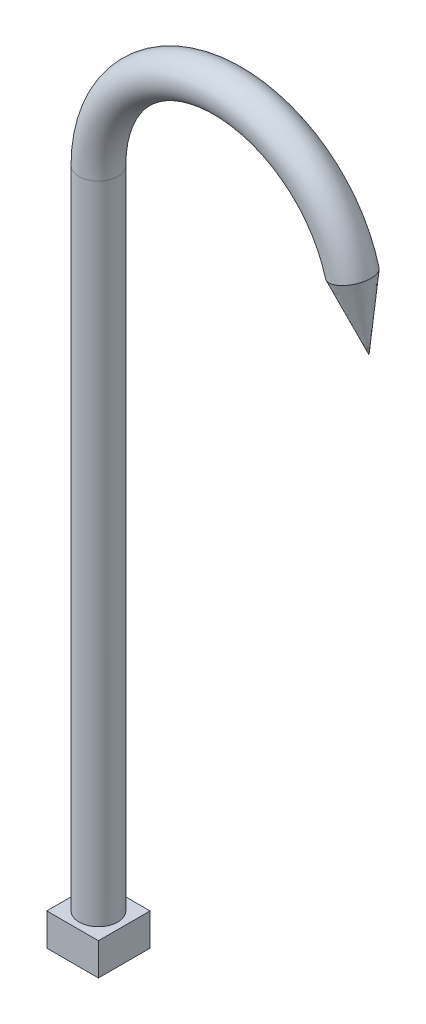
ISO-10303-21;
HEADER;
FILE_DESCRIPTION(('STEP AP214'),'2;1');
FILE_NAME('part.step','',(''),(''),'','','');
FILE_SCHEMA(('AUTOMOTIVE_DESIGN { 1 0 10303 214 1 1 1 1 }'));
ENDSEC;
DATA;
#1=APPLICATION_CONTEXT('core data for automotive mechanical design processes');
#2=APPLICATION_PROTOCOL_DEFINITION('international standard','automotive_design',2000,#1);
#3=PRODUCT_CONTEXT('',#1,'mechanical');
#4=PRODUCT('Part','Part','',(#3));
#5=PRODUCT_RELATED_PRODUCT_CATEGORY('part','',(#4));
#6=PRODUCT_DEFINITION_FORMATION('','',#4);
#7=PRODUCT_DEFINITION_CONTEXT('part definition',#1,'design');
#8=PRODUCT_DEFINITION('design','',#6,#7);
#9=PRODUCT_DEFINITION_SHAPE('','',#8);
#10=(LENGTH_UNIT() NAMED_UNIT(*) SI_UNIT(.MILLI.,.METRE.));
#11=(NAMED_UNIT(*) PLANE_ANGLE_UNIT() SI_UNIT($,.RADIAN.));
#12=(NAMED_UNIT(*) SI_UNIT($,.STERADIAN.) SOLID_ANGLE_UNIT());
#13=UNCERTAINTY_MEASURE_WITH_UNIT(LENGTH_MEASURE(1.E-05),#10,'distance_accuracy_value','');
#14=(GEOMETRIC_REPRESENTATION_CONTEXT(3) GLOBAL_UNCERTAINTY_ASSIGNED_CONTEXT((#13)) GLOBAL_UNIT_ASSIGNED_CONTEXT((#10,
#11,#12)) REPRESENTATION_CONTEXT('',''));
#15=CARTESIAN_POINT('',(0.,0.,0.));
#16=DIRECTION('',(0.,0.,1.));
#17=DIRECTION('',(1.,0.,0.));
#18=AXIS2_PLACEMENT_3D('',#15,#16,#17);
#19=CARTESIAN_POINT('',(0.,5.,0.));
#20=DIRECTION('',(0.,-1.,0.));
#21=DIRECTION('',(0.,0.,-1.));
#22=AXIS2_PLACEMENT_3D('',#19,#20,#21);
#23=PLANE('',#22);
#24=DIRECTION('',(0.,0.,-1.));
#25=VECTOR('',#24,1.);
#26=CARTESIAN_POINT('',(4.,5.,4.));
#27=LINE('',#26,#25);
#28=CARTESIAN_POINT('',(4.,5.,4.));
#29=VERTEX_POINT('',#28);
#30=CARTESIAN_POINT('',(4.,5.,-4.));
#31=VERTEX_POINT('',#30);
#32=EDGE_CURVE('E84',#29,#31,#27,.T.);
#33=ORIENTED_EDGE('',*,*,#32,.T.);
#34=DIRECTION('',(-1.,0.,0.));
#35=VECTOR('',#34,1.);
#36=CARTESIAN_POINT('',(-4.,5.,-4.));
#37=LINE('',#36,#35);
#38=CARTESIAN_POINT('',(-4.,5.,-4.));
#39=VERTEX_POINT('',#38);
#40=EDGE_CURVE('E78',#31,#39,#37,.T.);
#41=ORIENTED_EDGE('',*,*,#40,.T.);
#42=DIRECTION('',(0.,0.,1.));
#43=VECTOR('',#42,1.);
#44=CARTESIAN_POINT('',(-4.,5.,4.));
#45=LINE('',#44,#43);
#46=CARTESIAN_POINT('',(-4.,5.,4.));
#47=VERTEX_POINT('',#46);
#48=EDGE_CURVE('E81',#39,#47,#45,.T.);
#49=ORIENTED_EDGE('',*,*,#48,.T.);
#50=DIRECTION('',(1.,0.,0.));
#51=VECTOR('',#50,1.);
#52=CARTESIAN_POINT('',(-4.,5.,4.));
#53=LINE('',#52,#51);
#54=EDGE_CURVE('E50',#47,#29,#53,.T.);
#55=ORIENTED_EDGE('',*,*,#54,.T.);
#56=EDGE_LOOP('',(#33,#41,#49,#55));
#57=FACE_BOUND('',#56,.T.);
#58=CARTESIAN_POINT('',(0.,5.,0.));
#59=DIRECTION('',(0.,1.,0.));
#60=DIRECTION('',(0.,0.,1.));
#61=AXIS2_PLACEMENT_3D('',#58,#59,#60);
#62=CIRCLE('',#61,3.);
#63=CARTESIAN_POINT('',(0.,5.,3.));
#64=VERTEX_POINT('',#63);
#65=EDGE_CURVE('E11',#64,#64,#62,.T.);
#66=ORIENTED_EDGE('',*,*,#65,.F.);
#67=EDGE_LOOP('',(#66));
#68=FACE_BOUND('',#67,.T.);
#69=ADVANCED_FACE('F32',(#57,#68),#23,.F.);
#70=CARTESIAN_POINT('',(4.,5.,4.));
#71=DIRECTION('',(-1.,0.,0.));
#72=DIRECTION('',(0.,0.,1.));
#73=AXIS2_PLACEMENT_3D('',#70,#71,#72);
#74=PLANE('',#73);
#75=DIRECTION('',(0.,0.,-1.));
#76=VECTOR('',#75,1.);
#77=CARTESIAN_POINT('',(4.,0.,4.));
#78=LINE('',#77,#76);
#79=CARTESIAN_POINT('',(4.,0.,4.));
#80=VERTEX_POINT('',#79);
#81=CARTESIAN_POINT('',(4.,0.,-4.));
#82=VERTEX_POINT('',#81);
#83=EDGE_CURVE('E100',#80,#82,#78,.T.);
#84=ORIENTED_EDGE('',*,*,#83,.T.);
#85=DIRECTION('',(0.,-1.,0.));
#86=VECTOR('',#85,1.);
#87=CARTESIAN_POINT('',(4.,5.,-4.));
#88=LINE('',#87,#86);
#89=EDGE_CURVE('E36',#31,#82,#88,.T.);
#90=ORIENTED_EDGE('',*,*,#89,.F.);
#91=ORIENTED_EDGE('',*,*,#32,.F.);
#92=DIRECTION('',(0.,-1.,0.));
#93=VECTOR('',#92,1.);
#94=CARTESIAN_POINT('',(4.,5.,4.));
#95=LINE('',#94,#93);
#96=EDGE_CURVE('E96',#29,#80,#95,.T.);
#97=ORIENTED_EDGE('',*,*,#96,.T.);
#98=EDGE_LOOP('',(#84,#90,#91,#97));
#99=FACE_BOUND('',#98,.T.);
#100=ADVANCED_FACE('F114',(#99),#74,.F.);
#101=CARTESIAN_POINT('',(-4.,5.,-4.));
#102=DIRECTION('',(0.,0.,1.));
#103=DIRECTION('',(1.,0.,0.));
#104=AXIS2_PLACEMENT_3D('',#101,#102,#103);
#105=PLANE('',#104);
#106=DIRECTION('',(-1.,0.,0.));
#107=VECTOR('',#106,1.);
#108=CARTESIAN_POINT('',(-4.,0.,-4.));
#109=LINE('',#108,#107);
#110=CARTESIAN_POINT('',(-4.,0.,-4.));
#111=VERTEX_POINT('',#110);
#112=EDGE_CURVE('E90',#82,#111,#109,.T.);
#113=ORIENTED_EDGE('',*,*,#112,.T.);
#114=DIRECTION('',(0.,-1.,0.));
#115=VECTOR('',#114,1.);
#116=CARTESIAN_POINT('',(-4.,5.,-4.));
#117=LINE('',#116,#115);
#118=EDGE_CURVE('E88',#39,#111,#117,.T.);
#119=ORIENTED_EDGE('',*,*,#118,.F.);
#120=ORIENTED_EDGE('',*,*,#40,.F.);
#121=ORIENTED_EDGE('',*,*,#89,.T.);
#122=EDGE_LOOP('',(#113,#119,#120,#121));
#123=FACE_BOUND('',#122,.T.);
#124=ADVANCED_FACE('F89',(#123),#105,.F.);
#125=CARTESIAN_POINT('',(-4.,5.,4.));
#126=DIRECTION('',(1.,0.,0.));
#127=DIRECTION('',(0.,0.,-1.));
#128=AXIS2_PLACEMENT_3D('',#125,#126,#127);
#129=PLANE('',#128);
#130=DIRECTION('',(0.,0.,1.));
#131=VECTOR('',#130,1.);
#132=CARTESIAN_POINT('',(-4.,0.,4.));
#133=LINE('',#132,#131);
#134=CARTESIAN_POINT('',(-4.,0.,4.));
#135=VERTEX_POINT('',#134);
#136=EDGE_CURVE('E105',#111,#135,#133,.T.);
#137=ORIENTED_EDGE('',*,*,#136,.T.);
#138=DIRECTION('',(0.,-1.,0.));
#139=VECTOR('',#138,1.);
#140=CARTESIAN_POINT('',(-4.,5.,4.));
#141=LINE('',#140,#139);
#142=EDGE_CURVE('E93',#47,#135,#141,.T.);
#143=ORIENTED_EDGE('',*,*,#142,.F.);
#144=ORIENTED_EDGE('',*,*,#48,.F.);
#145=ORIENTED_EDGE('',*,*,#118,.T.);
#146=EDGE_LOOP('',(#137,#143,#144,#145));
#147=FACE_BOUND('',#146,.T.);
#148=ADVANCED_FACE('F94',(#147),#129,.F.);
#149=CARTESIAN_POINT('',(-4.,5.,4.));
#150=DIRECTION('',(0.,0.,-1.));
#151=DIRECTION('',(-1.,0.,0.));
#152=AXIS2_PLACEMENT_3D('',#149,#150,#151);
#153=PLANE('',#152);
#154=DIRECTION('',(1.,0.,0.));
#155=VECTOR('',#154,1.);
#156=CARTESIAN_POINT('',(-4.,0.,4.));
#157=LINE('',#156,#155);
#158=EDGE_CURVE('E70',#135,#80,#157,.T.);
#159=ORIENTED_EDGE('',*,*,#158,.T.);
#160=ORIENTED_EDGE('',*,*,#96,.F.);
#161=ORIENTED_EDGE('',*,*,#54,.F.);
#162=ORIENTED_EDGE('',*,*,#142,.T.);
#163=EDGE_LOOP('',(#159,#160,#161,#162));
#164=FACE_BOUND('',#163,.T.);
#165=ADVANCED_FACE('F109',(#164),#153,.F.);
#166=CARTESIAN_POINT('',(0.,0.,0.));
#167=DIRECTION('',(0.,-1.,0.));
#168=DIRECTION('',(0.,0.,-1.));
#169=AXIS2_PLACEMENT_3D('',#166,#167,#168);
#170=PLANE('',#169);
#171=ORIENTED_EDGE('',*,*,#83,.F.);
#172=ORIENTED_EDGE('',*,*,#158,.F.);
#173=ORIENTED_EDGE('',*,*,#136,.F.);
#174=ORIENTED_EDGE('',*,*,#112,.F.);
#175=EDGE_LOOP('',(#171,#172,#173,#174));
#176=FACE_BOUND('',#175,.T.);
#177=ADVANCED_FACE('F112',(#176),#170,.T.);
#178=CARTESIAN_POINT('',(20.,105.,0.));
#179=DIRECTION('',(0.,0.,-1.));
#180=DIRECTION('',(-1.,0.,0.));
#181=AXIS2_PLACEMENT_3D('',#178,#179,#180);
#182=TOROIDAL_SURFACE('',#181,20.,3.);
#183=CARTESIAN_POINT('',(0.,105.,0.));
#184=DIRECTION('',(0.,1.,0.));
#185=DIRECTION('',(0.,0.,1.));
#186=AXIS2_PLACEMENT_3D('',#183,#184,#185);
#187=CIRCLE('',#186,3.);
#188=CARTESIAN_POINT('',(-3.,105.,0.));
#189=VERTEX_POINT('',#188);
#190=EDGE_CURVE('E117',#189,#189,#187,.T.);
#191=CARTESIAN_POINT('',(39.3185165257814,110.17638090205,0.));
#192=DIRECTION('',(0.258819045102515,-0.96592582628907,0.));
#193=DIRECTION('',(0.,0.,1.));
#194=AXIS2_PLACEMENT_3D('',#191,#192,#193);
#195=CIRCLE('',#194,3.);
#196=CARTESIAN_POINT('',(42.2162940046486,110.952838037358,0.));
#197=VERTEX_POINT('',#196);
#198=EDGE_CURVE('E103',#197,#197,#195,.T.);
#199=CARTESIAN_POINT('',(20.,105.,0.));
#200=DIRECTION('',(0.,0.,-1.));
#201=DIRECTION('',(-1.,0.,0.));
#202=AXIS2_PLACEMENT_3D('',#199,#200,#201);
#203=CIRCLE('',#202,23.);
#204=EDGE_CURVE('',#189,#197,#203,.T.);
#205=ORIENTED_EDGE('',*,*,#190,.T.);
#206=ORIENTED_EDGE('',*,*,#198,.F.);
#207=ORIENTED_EDGE('',*,*,#204,.T.);
#208=ORIENTED_EDGE('',*,*,#204,.F.);
#209=EDGE_LOOP('',(#205,#207,#206,#208));
#210=FACE_BOUND('',#209,.T.);
#211=ADVANCED_FACE('F122',(#210),#182,.T.);
#212=CARTESIAN_POINT('',(0.,105.,0.));
#213=DIRECTION('',(0.,-1.,0.));
#214=DIRECTION('',(1.,0.,0.));
#215=AXIS2_PLACEMENT_3D('',#212,#213,#214);
#216=CYLINDRICAL_SURFACE('',#215,3.);
#217=ORIENTED_EDGE('',*,*,#190,.F.);
#218=EDGE_LOOP('',(#217));
#219=FACE_BOUND('',#218,.T.);
#220=ORIENTED_EDGE('',*,*,#65,.T.);
#221=EDGE_LOOP('',(#220));
#222=FACE_BOUND('',#221,.T.);
#223=ADVANCED_FACE('F125',(#219,#222),#216,.T.);
#224=CARTESIAN_POINT('',(39.3185165257814,110.17638090205,0.));
#225=DIRECTION('',(-0.258819045102515,0.96592582628907,0.));
#226=DIRECTION('',(-0.96592582628907,-0.258819045102515,0.));
#227=AXIS2_PLACEMENT_3D('',#224,#225,#226);
#228=CONICAL_SURFACE('',#227,2.99999999999998,0.291456794477865);
#229=ORIENTED_EDGE('',*,*,#198,.T.);
#230=EDGE_LOOP('',(#229));
#231=FACE_BOUND('',#230,.T.);
#232=CARTESIAN_POINT('',(41.9067069768065,100.51712263916,0.));
#233=VERTEX_POINT('',#232);
#234=VERTEX_LOOP('',#233);
#235=FACE_BOUND('',#234,.T.);
#236=ADVANCED_FACE('F34',(#231,#235),#228,.T.);
#237=CLOSED_SHELL('',(#69,#100,#124,#148,#165,#177,#211,#223,#236));
#238=MANIFOLD_SOLID_BREP('B2',#237);
#239=ADVANCED_BREP_SHAPE_REPRESENTATION('',(#18,#238),#14);
#240=SHAPE_DEFINITION_REPRESENTATION(#9,#239);
ENDSEC;
END-ISO-10303-21;
